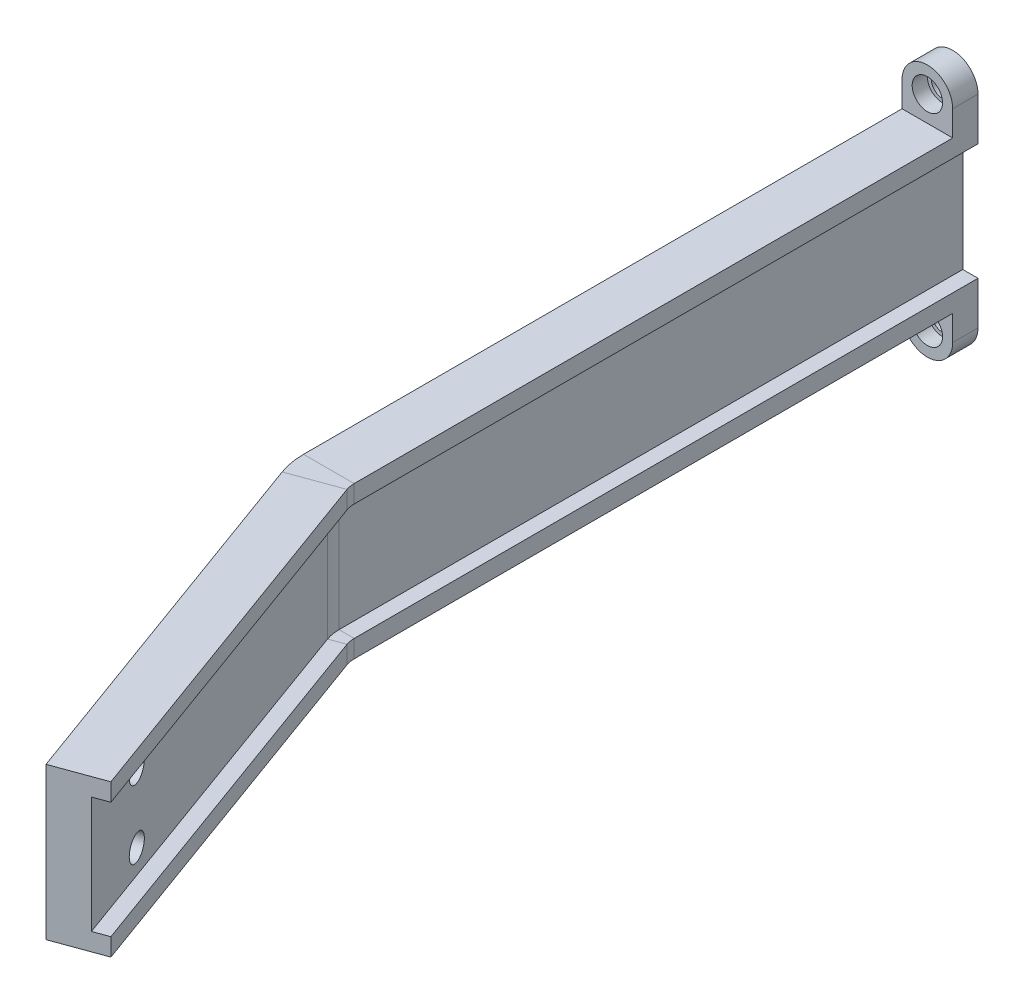
ISO-10303-21;
HEADER;
FILE_DESCRIPTION(('STEP AP214'),'2;1');
FILE_NAME('part.step','',(''),(''),'','','');
FILE_SCHEMA(('AUTOMOTIVE_DESIGN { 1 0 10303 214 1 1 1 1 }'));
ENDSEC;
DATA;
#1=APPLICATION_CONTEXT('core data for automotive mechanical design processes');
#2=APPLICATION_PROTOCOL_DEFINITION('international standard','automotive_design',2000,#1);
#3=PRODUCT_CONTEXT('',#1,'mechanical');
#4=PRODUCT('Part','Part','',(#3));
#5=PRODUCT_RELATED_PRODUCT_CATEGORY('part','',(#4));
#6=PRODUCT_DEFINITION_FORMATION('','',#4);
#7=PRODUCT_DEFINITION_CONTEXT('part definition',#1,'design');
#8=PRODUCT_DEFINITION('design','',#6,#7);
#9=PRODUCT_DEFINITION_SHAPE('','',#8);
#10=(LENGTH_UNIT() NAMED_UNIT(*) SI_UNIT(.MILLI.,.METRE.));
#11=(NAMED_UNIT(*) PLANE_ANGLE_UNIT() SI_UNIT($,.RADIAN.));
#12=(NAMED_UNIT(*) SI_UNIT($,.STERADIAN.) SOLID_ANGLE_UNIT());
#13=UNCERTAINTY_MEASURE_WITH_UNIT(LENGTH_MEASURE(1.E-05),#10,'distance_accuracy_value','');
#14=(GEOMETRIC_REPRESENTATION_CONTEXT(3) GLOBAL_UNCERTAINTY_ASSIGNED_CONTEXT((#13)) GLOBAL_UNIT_ASSIGNED_CONTEXT((#10,
#11,#12)) REPRESENTATION_CONTEXT('',''));
#15=CARTESIAN_POINT('',(0.,0.,0.));
#16=DIRECTION('',(0.,0.,1.));
#17=DIRECTION('',(1.,0.,0.));
#18=AXIS2_PLACEMENT_3D('',#15,#16,#17);
#19=CARTESIAN_POINT('',(-152.297767569966,11.5,9.99999999999995));
#20=DIRECTION('',(1.,0.,0.));
#21=DIRECTION('',(0.,0.,-1.));
#22=AXIS2_PLACEMENT_3D('',#19,#20,#21);
#23=PLANE('',#22);
#24=DIRECTION('',(0.,0.,1.));
#25=VECTOR('',#24,1.);
#26=CARTESIAN_POINT('',(-152.297767569966,11.5,9.99999999999995));
#27=LINE('',#26,#25);
#28=CARTESIAN_POINT('',(-152.297767569966,11.5,155.));
#29=VERTEX_POINT('',#28);
#30=CARTESIAN_POINT('',(-152.297767569965,11.5,278.236730192915));
#31=VERTEX_POINT('',#30);
#32=EDGE_CURVE('E242',#29,#31,#27,.T.);
#33=ORIENTED_EDGE('',*,*,#32,.F.);
#34=DIRECTION('',(0.,1.,0.));
#35=VECTOR('',#34,1.);
#36=CARTESIAN_POINT('',(-152.297767569966,11.5,155.));
#37=LINE('',#36,#35);
#38=CARTESIAN_POINT('',(-152.297767569965,20.,155.));
#39=VERTEX_POINT('',#38);
#40=EDGE_CURVE('E433',#29,#39,#37,.T.);
#41=ORIENTED_EDGE('',*,*,#40,.T.);
#42=DIRECTION('',(0.,0.,-1.));
#43=VECTOR('',#42,1.);
#44=CARTESIAN_POINT('',(-152.297767569965,20.,160.));
#45=LINE('',#44,#43);
#46=CARTESIAN_POINT('',(-152.297767569965,20.,160.));
#47=VERTEX_POINT('',#46);
#48=EDGE_CURVE('E227',#47,#39,#45,.T.);
#49=ORIENTED_EDGE('',*,*,#48,.F.);
#50=DIRECTION('',(0.,1.,0.));
#51=VECTOR('',#50,1.);
#52=CARTESIAN_POINT('',(-152.297767569965,15.,160.));
#53=LINE('',#52,#51);
#54=CARTESIAN_POINT('',(-152.297767569966,15.,160.));
#55=VERTEX_POINT('',#54);
#56=EDGE_CURVE('E222',#55,#47,#53,.T.);
#57=ORIENTED_EDGE('',*,*,#56,.F.);
#58=DIRECTION('',(0.,0.,1.));
#59=VECTOR('',#58,1.);
#60=CARTESIAN_POINT('',(-152.297767569966,15.,9.99999999999995));
#61=LINE('',#60,#59);
#62=CARTESIAN_POINT('',(-152.297767569965,15.,278.236730192915));
#63=VERTEX_POINT('',#62);
#64=EDGE_CURVE('E246',#55,#63,#61,.T.);
#65=ORIENTED_EDGE('',*,*,#64,.T.);
#66=DIRECTION('',(0.,1.,0.));
#67=VECTOR('',#66,1.);
#68=CARTESIAN_POINT('',(-152.297767569965,11.5,278.236730192915));
#69=LINE('',#68,#67);
#70=EDGE_CURVE('E243',#31,#63,#69,.T.);
#71=ORIENTED_EDGE('',*,*,#70,.F.);
#72=EDGE_LOOP('',(#33,#41,#49,#57,#65,#71));
#73=FACE_BOUND('',#72,.T.);
#74=ADVANCED_FACE('F41',(#73),#23,.T.);
#75=CARTESIAN_POINT('',(-162.297767569966,-15.,9.99999999999995));
#76=DIRECTION('',(-1.,0.,0.));
#77=DIRECTION('',(0.,0.,1.));
#78=AXIS2_PLACEMENT_3D('',#75,#76,#77);
#79=PLANE('',#78);
#80=DIRECTION('',(0.,0.,-1.));
#81=VECTOR('',#80,1.);
#82=CARTESIAN_POINT('',(-162.297767569965,20.,160.));
#83=LINE('',#82,#81);
#84=CARTESIAN_POINT('',(-162.297767569965,20.,160.));
#85=VERTEX_POINT('',#84);
#86=CARTESIAN_POINT('',(-162.297767569966,20.,155.));
#87=VERTEX_POINT('',#86);
#88=EDGE_CURVE('E196',#85,#87,#83,.T.);
#89=ORIENTED_EDGE('',*,*,#88,.T.);
#90=DIRECTION('',(0.,-1.,0.));
#91=VECTOR('',#90,1.);
#92=CARTESIAN_POINT('',(-162.297767569966,-15.,155.));
#93=LINE('',#92,#91);
#94=CARTESIAN_POINT('',(-162.297767569965,-20.,155.));
#95=VERTEX_POINT('',#94);
#96=EDGE_CURVE('E179',#87,#95,#93,.T.);
#97=ORIENTED_EDGE('',*,*,#96,.T.);
#98=DIRECTION('',(0.,0.,-1.));
#99=VECTOR('',#98,1.);
#100=CARTESIAN_POINT('',(-162.297767569965,-20.,160.));
#101=LINE('',#100,#99);
#102=CARTESIAN_POINT('',(-162.297767569965,-20.,160.));
#103=VERTEX_POINT('',#102);
#104=EDGE_CURVE('E192',#103,#95,#101,.T.);
#105=ORIENTED_EDGE('',*,*,#104,.F.);
#106=DIRECTION('',(0.,-1.,0.));
#107=VECTOR('',#106,1.);
#108=CARTESIAN_POINT('',(-162.297767569965,-15.,160.));
#109=LINE('',#108,#107);
#110=CARTESIAN_POINT('',(-162.297767569966,-15.,160.));
#111=VERTEX_POINT('',#110);
#112=EDGE_CURVE('E202',#111,#103,#109,.T.);
#113=ORIENTED_EDGE('',*,*,#112,.F.);
#114=DIRECTION('',(0.,0.,1.));
#115=VECTOR('',#114,1.);
#116=CARTESIAN_POINT('',(-162.297767569966,-15.,9.99999999999995));
#117=LINE('',#116,#115);
#118=CARTESIAN_POINT('',(-162.297767569965,-15.,278.236730192915));
#119=VERTEX_POINT('',#118);
#120=EDGE_CURVE('E64',#111,#119,#117,.T.);
#121=ORIENTED_EDGE('',*,*,#120,.T.);
#122=DIRECTION('',(0.,-1.,0.));
#123=VECTOR('',#122,1.);
#124=CARTESIAN_POINT('',(-162.297767569965,-15.,278.236730192915));
#125=LINE('',#124,#123);
#126=CARTESIAN_POINT('',(-162.297767569965,15.,278.236730192915));
#127=VERTEX_POINT('',#126);
#128=EDGE_CURVE('E275',#127,#119,#125,.T.);
#129=ORIENTED_EDGE('',*,*,#128,.F.);
#130=DIRECTION('',(0.,0.,1.));
#131=VECTOR('',#130,1.);
#132=CARTESIAN_POINT('',(-162.297767569966,15.,9.99999999999995));
#133=LINE('',#132,#131);
#134=CARTESIAN_POINT('',(-162.297767569965,15.,160.));
#135=VERTEX_POINT('',#134);
#136=EDGE_CURVE('E273',#135,#127,#133,.T.);
#137=ORIENTED_EDGE('',*,*,#136,.F.);
#138=DIRECTION('',(0.,-1.,0.));
#139=VECTOR('',#138,1.);
#140=CARTESIAN_POINT('',(-162.297767569965,15.,160.));
#141=LINE('',#140,#139);
#142=EDGE_CURVE('E216',#85,#135,#141,.T.);
#143=ORIENTED_EDGE('',*,*,#142,.F.);
#144=EDGE_LOOP('',(#89,#97,#105,#113,#121,#129,#137,#143));
#145=FACE_BOUND('',#144,.T.);
#146=ADVANCED_FACE('F190',(#145),#79,.T.);
#147=CARTESIAN_POINT('',(-152.297767569966,-15.,9.99999999999995));
#148=DIRECTION('',(1.,1.50408162385987E-13,0.));
#149=DIRECTION('',(-1.50408162385987E-13,1.,0.));
#150=AXIS2_PLACEMENT_3D('',#147,#148,#149);
#151=PLANE('',#150);
#152=DIRECTION('',(0.,0.,-1.));
#153=VECTOR('',#152,1.);
#154=CARTESIAN_POINT('',(-152.297767569965,-20.,160.));
#155=LINE('',#154,#153);
#156=CARTESIAN_POINT('',(-152.297767569965,-20.,160.));
#157=VERTEX_POINT('',#156);
#158=CARTESIAN_POINT('',(-152.297767569965,-20.,155.));
#159=VERTEX_POINT('',#158);
#160=EDGE_CURVE('E203',#157,#159,#155,.T.);
#161=ORIENTED_EDGE('',*,*,#160,.T.);
#162=DIRECTION('',(-1.50408162385987E-13,1.,0.));
#163=VECTOR('',#162,1.);
#164=CARTESIAN_POINT('',(-152.297767569966,-15.,155.));
#165=LINE('',#164,#163);
#166=CARTESIAN_POINT('',(-152.297767569966,-11.5,155.));
#167=VERTEX_POINT('',#166);
#168=EDGE_CURVE('E56',#159,#167,#165,.T.);
#169=ORIENTED_EDGE('',*,*,#168,.T.);
#170=DIRECTION('',(0.,0.,1.));
#171=VECTOR('',#170,1.);
#172=CARTESIAN_POINT('',(-152.297767569966,-11.5,9.99999999999995));
#173=LINE('',#172,#171);
#174=CARTESIAN_POINT('',(-152.297767569966,-11.5,278.236730192915));
#175=VERTEX_POINT('',#174);
#176=EDGE_CURVE('E320',#167,#175,#173,.T.);
#177=ORIENTED_EDGE('',*,*,#176,.T.);
#178=DIRECTION('',(-1.50408162385987E-13,1.,0.));
#179=VECTOR('',#178,1.);
#180=CARTESIAN_POINT('',(-152.297767569965,-15.,278.236730192915));
#181=LINE('',#180,#179);
#182=CARTESIAN_POINT('',(-152.297767569965,-15.,278.236730192915));
#183=VERTEX_POINT('',#182);
#184=EDGE_CURVE('E306',#183,#175,#181,.T.);
#185=ORIENTED_EDGE('',*,*,#184,.F.);
#186=DIRECTION('',(0.,0.,1.));
#187=VECTOR('',#186,1.);
#188=CARTESIAN_POINT('',(-152.297767569966,-15.,9.99999999999995));
#189=LINE('',#188,#187);
#190=CARTESIAN_POINT('',(-152.297767569965,-15.,160.));
#191=VERTEX_POINT('',#190);
#192=EDGE_CURVE('E304',#191,#183,#189,.T.);
#193=ORIENTED_EDGE('',*,*,#192,.F.);
#194=DIRECTION('',(0.,1.,0.));
#195=VECTOR('',#194,1.);
#196=CARTESIAN_POINT('',(-152.297767569965,-15.,160.));
#197=LINE('',#196,#195);
#198=EDGE_CURVE('E212',#157,#191,#197,.T.);
#199=ORIENTED_EDGE('',*,*,#198,.F.);
#200=EDGE_LOOP('',(#161,#169,#177,#185,#193,#199));
#201=FACE_BOUND('',#200,.T.);
#202=ADVANCED_FACE('F409',(#201),#151,.T.);
#203=CARTESIAN_POINT('',(-155.297767569966,-11.5,9.99999999999995));
#204=DIRECTION('',(0.,1.,0.));
#205=DIRECTION('',(0.,0.,1.));
#206=AXIS2_PLACEMENT_3D('',#203,#204,#205);
#207=PLANE('',#206);
#208=ORIENTED_EDGE('',*,*,#176,.F.);
#209=DIRECTION('',(-1.,0.,0.));
#210=VECTOR('',#209,1.);
#211=CARTESIAN_POINT('',(-155.297767569966,-11.5,155.));
#212=LINE('',#211,#210);
#213=CARTESIAN_POINT('',(-155.297767569966,-11.5,155.));
#214=VERTEX_POINT('',#213);
#215=EDGE_CURVE('E421',#167,#214,#212,.T.);
#216=ORIENTED_EDGE('',*,*,#215,.T.);
#217=DIRECTION('',(0.,0.,1.));
#218=VECTOR('',#217,1.);
#219=CARTESIAN_POINT('',(-155.297767569966,-11.5,9.99999999999995));
#220=LINE('',#219,#218);
#221=CARTESIAN_POINT('',(-155.297767569965,-11.5,278.236730192915));
#222=VERTEX_POINT('',#221);
#223=EDGE_CURVE('E336',#214,#222,#220,.T.);
#224=ORIENTED_EDGE('',*,*,#223,.T.);
#225=DIRECTION('',(-1.,0.,0.));
#226=VECTOR('',#225,1.);
#227=CARTESIAN_POINT('',(-155.297767569965,-11.5,278.236730192915));
#228=LINE('',#227,#226);
#229=EDGE_CURVE('E322',#175,#222,#228,.T.);
#230=ORIENTED_EDGE('',*,*,#229,.F.);
#231=EDGE_LOOP('',(#208,#216,#224,#230));
#232=FACE_BOUND('',#231,.T.);
#233=ADVANCED_FACE('F418',(#232),#207,.T.);
#234=CARTESIAN_POINT('',(-155.297767569966,-11.5,9.99999999999995));
#235=DIRECTION('',(1.,0.,0.));
#236=DIRECTION('',(0.,0.,-1.));
#237=AXIS2_PLACEMENT_3D('',#234,#235,#236);
#238=PLANE('',#237);
#239=ORIENTED_EDGE('',*,*,#223,.F.);
#240=DIRECTION('',(0.,1.,0.));
#241=VECTOR('',#240,1.);
#242=CARTESIAN_POINT('',(-155.297767569966,-11.5,155.));
#243=LINE('',#242,#241);
#244=CARTESIAN_POINT('',(-155.297767569966,11.5,155.));
#245=VERTEX_POINT('',#244);
#246=EDGE_CURVE('E429',#214,#245,#243,.T.);
#247=ORIENTED_EDGE('',*,*,#246,.T.);
#248=DIRECTION('',(0.,0.,1.));
#249=VECTOR('',#248,1.);
#250=CARTESIAN_POINT('',(-155.297767569966,11.5,9.99999999999995));
#251=LINE('',#250,#249);
#252=CARTESIAN_POINT('',(-155.297767569965,11.5,278.236730192915));
#253=VERTEX_POINT('',#252);
#254=EDGE_CURVE('E352',#245,#253,#251,.T.);
#255=ORIENTED_EDGE('',*,*,#254,.T.);
#256=DIRECTION('',(0.,1.,0.));
#257=VECTOR('',#256,1.);
#258=CARTESIAN_POINT('',(-155.297767569965,-11.5,278.236730192915));
#259=LINE('',#258,#257);
#260=EDGE_CURVE('E338',#222,#253,#259,.T.);
#261=ORIENTED_EDGE('',*,*,#260,.F.);
#262=EDGE_LOOP('',(#239,#247,#255,#261));
#263=FACE_BOUND('',#262,.T.);
#264=ADVANCED_FACE('F428',(#263),#238,.T.);
#265=CARTESIAN_POINT('',(-155.297767569966,11.5,9.99999999999995));
#266=DIRECTION('',(0.,-1.,0.));
#267=DIRECTION('',(0.,0.,-1.));
#268=AXIS2_PLACEMENT_3D('',#265,#266,#267);
#269=PLANE('',#268);
#270=ORIENTED_EDGE('',*,*,#254,.F.);
#271=DIRECTION('',(1.,0.,0.));
#272=VECTOR('',#271,1.);
#273=CARTESIAN_POINT('',(-155.297767569966,11.5,155.));
#274=LINE('',#273,#272);
#275=EDGE_CURVE('E432',#245,#29,#274,.T.);
#276=ORIENTED_EDGE('',*,*,#275,.T.);
#277=ORIENTED_EDGE('',*,*,#32,.T.);
#278=DIRECTION('',(1.,0.,0.));
#279=VECTOR('',#278,1.);
#280=CARTESIAN_POINT('',(-155.297767569965,11.5,278.236730192915));
#281=LINE('',#280,#279);
#282=EDGE_CURVE('E260',#253,#31,#281,.T.);
#283=ORIENTED_EDGE('',*,*,#282,.F.);
#284=EDGE_LOOP('',(#270,#276,#277,#283));
#285=FACE_BOUND('',#284,.T.);
#286=ADVANCED_FACE('F431',(#285),#269,.T.);
#287=CARTESIAN_POINT('',(-157.297767569965,20.,160.));
#288=DIRECTION('',(0.,0.,-1.));
#289=DIRECTION('',(-1.,0.,0.));
#290=AXIS2_PLACEMENT_3D('',#287,#288,#289);
#291=CYLINDRICAL_SURFACE('',#290,5.);
#292=CARTESIAN_POINT('',(-157.297767569965,20.,155.));
#293=DIRECTION('',(0.,0.,-1.));
#294=DIRECTION('',(-1.,0.,0.));
#295=AXIS2_PLACEMENT_3D('',#292,#293,#294);
#296=CIRCLE('',#295,5.);
#297=EDGE_CURVE('E197',#87,#39,#296,.T.);
#298=ORIENTED_EDGE('',*,*,#297,.F.);
#299=ORIENTED_EDGE('',*,*,#88,.F.);
#300=CARTESIAN_POINT('',(-157.297767569965,20.,160.));
#301=DIRECTION('',(0.,0.,1.));
#302=DIRECTION('',(1.,0.,0.));
#303=AXIS2_PLACEMENT_3D('',#300,#301,#302);
#304=CIRCLE('',#303,5.);
#305=EDGE_CURVE('E224',#47,#85,#304,.T.);
#306=ORIENTED_EDGE('',*,*,#305,.F.);
#307=ORIENTED_EDGE('',*,*,#48,.T.);
#308=EDGE_LOOP('',(#298,#299,#306,#307));
#309=FACE_BOUND('',#308,.T.);
#310=ADVANCED_FACE('F550',(#309),#291,.T.);
#311=CARTESIAN_POINT('',(-157.297767569965,-20.,160.));
#312=DIRECTION('',(0.,0.,-1.));
#313=DIRECTION('',(-1.,0.,0.));
#314=AXIS2_PLACEMENT_3D('',#311,#312,#313);
#315=CYLINDRICAL_SURFACE('',#314,5.);
#316=CARTESIAN_POINT('',(-157.297767569965,-20.,155.));
#317=DIRECTION('',(0.,0.,-1.));
#318=DIRECTION('',(-1.,0.,0.));
#319=AXIS2_PLACEMENT_3D('',#316,#317,#318);
#320=CIRCLE('',#319,5.);
#321=EDGE_CURVE('E175',#159,#95,#320,.T.);
#322=ORIENTED_EDGE('',*,*,#321,.F.);
#323=ORIENTED_EDGE('',*,*,#160,.F.);
#324=CARTESIAN_POINT('',(-157.297767569965,-20.,160.));
#325=DIRECTION('',(0.,0.,1.));
#326=DIRECTION('',(-1.,0.,0.));
#327=AXIS2_PLACEMENT_3D('',#324,#325,#326);
#328=CIRCLE('',#327,5.);
#329=EDGE_CURVE('E201',#103,#157,#328,.T.);
#330=ORIENTED_EDGE('',*,*,#329,.F.);
#331=ORIENTED_EDGE('',*,*,#104,.T.);
#332=EDGE_LOOP('',(#322,#323,#330,#331));
#333=FACE_BOUND('',#332,.T.);
#334=ADVANCED_FACE('F199',(#333),#315,.T.);
#335=CARTESIAN_POINT('',(-157.297767569965,-20.,160.));
#336=DIRECTION('',(0.,0.,1.));
#337=DIRECTION('',(1.,0.,0.));
#338=AXIS2_PLACEMENT_3D('',#335,#336,#337);
#339=CYLINDRICAL_SURFACE('',#338,2.25);
#340=CARTESIAN_POINT('',(-157.297767569965,-20.,157.));
#341=DIRECTION('',(0.,0.,1.));
#342=DIRECTION('',(1.,0.,0.));
#343=AXIS2_PLACEMENT_3D('',#340,#341,#342);
#344=CIRCLE('',#343,2.25);
#345=CARTESIAN_POINT('',(-155.047767569965,-20.,157.));
#346=VERTEX_POINT('',#345);
#347=EDGE_CURVE('E207',#346,#346,#344,.T.);
#348=ORIENTED_EDGE('',*,*,#347,.T.);
#349=EDGE_LOOP('',(#348));
#350=FACE_BOUND('',#349,.T.);
#351=CARTESIAN_POINT('',(-157.297767569965,-20.,155.));
#352=DIRECTION('',(0.,0.,-1.));
#353=DIRECTION('',(-1.,0.,0.));
#354=AXIS2_PLACEMENT_3D('',#351,#352,#353);
#355=CIRCLE('',#354,2.25);
#356=CARTESIAN_POINT('',(-159.547767569965,-20.,155.));
#357=VERTEX_POINT('',#356);
#358=EDGE_CURVE('E435',#357,#357,#355,.F.);
#359=ORIENTED_EDGE('',*,*,#358,.F.);
#360=EDGE_LOOP('',(#359));
#361=FACE_BOUND('',#360,.T.);
#362=ADVANCED_FACE('F459',(#350,#361),#339,.F.);
#363=CARTESIAN_POINT('',(-162.297767569966,-15.,9.99999999999995));
#364=DIRECTION('',(0.,-1.,0.));
#365=DIRECTION('',(1.,0.,0.));
#366=AXIS2_PLACEMENT_3D('',#363,#364,#365);
#367=PLANE('',#366);
#368=ORIENTED_EDGE('',*,*,#120,.F.);
#369=DIRECTION('',(-1.,0.,0.));
#370=VECTOR('',#369,1.);
#371=CARTESIAN_POINT('',(-162.297767569965,-15.,160.));
#372=LINE('',#371,#370);
#373=EDGE_CURVE('E205',#191,#111,#372,.T.);
#374=ORIENTED_EDGE('',*,*,#373,.F.);
#375=ORIENTED_EDGE('',*,*,#192,.T.);
#376=DIRECTION('',(1.,0.,0.));
#377=VECTOR('',#376,1.);
#378=CARTESIAN_POINT('',(-162.297767569965,-15.,278.236730192915));
#379=LINE('',#378,#377);
#380=EDGE_CURVE('E290',#119,#183,#379,.T.);
#381=ORIENTED_EDGE('',*,*,#380,.F.);
#382=EDGE_LOOP('',(#368,#374,#375,#381));
#383=FACE_BOUND('',#382,.T.);
#384=ADVANCED_FACE('F402',(#383),#367,.T.);
#385=CARTESIAN_POINT('',(98.8876895220948,0.,271.691694023993));
#386=DIRECTION('',(-0.342020143325671,0.,-0.939692620785908));
#387=DIRECTION('',(-0.939692620785908,0.,0.342020143325671));
#388=AXIS2_PLACEMENT_3D('',#385,#386,#387);
#389=PLANE('',#388);
#390=DIRECTION('',(0.,1.,0.));
#391=VECTOR('',#390,1.);
#392=CARTESIAN_POINT('',(-125.30153689607,11.5,353.289899283372));
#393=LINE('',#392,#391);
#394=CARTESIAN_POINT('',(-125.30153689607,11.5,353.289899283372));
#395=VERTEX_POINT('',#394);
#396=CARTESIAN_POINT('',(-125.30153689607,15.,353.289899283372));
#397=VERTEX_POINT('',#396);
#398=EDGE_CURVE('E261',#395,#397,#393,.T.);
#399=ORIENTED_EDGE('',*,*,#398,.T.);
#400=DIRECTION('',(-0.939692620785908,0.,0.342020143325671));
#401=VECTOR('',#400,1.);
#402=CARTESIAN_POINT('',(-134.69846310393,15.,356.710100716628));
#403=LINE('',#402,#401);
#404=CARTESIAN_POINT('',(-134.69846310393,15.,356.710100716628));
#405=VERTEX_POINT('',#404);
#406=EDGE_CURVE('E267',#397,#405,#403,.T.);
#407=ORIENTED_EDGE('',*,*,#406,.T.);
#408=DIRECTION('',(0.,-1.,0.));
#409=VECTOR('',#408,1.);
#410=CARTESIAN_POINT('',(-134.69846310393,-15.,356.710100716628));
#411=LINE('',#410,#409);
#412=CARTESIAN_POINT('',(-134.69846310393,-15.,356.710100716628));
#413=VERTEX_POINT('',#412);
#414=EDGE_CURVE('E286',#405,#413,#411,.T.);
#415=ORIENTED_EDGE('',*,*,#414,.T.);
#416=DIRECTION('',(0.939692620785908,0.,-0.342020143325671));
#417=VECTOR('',#416,1.);
#418=CARTESIAN_POINT('',(-134.69846310393,-15.,356.710100716628));
#419=LINE('',#418,#417);
#420=CARTESIAN_POINT('',(-125.30153689607,-15.,353.289899283372));
#421=VERTEX_POINT('',#420);
#422=EDGE_CURVE('E301',#413,#421,#419,.T.);
#423=ORIENTED_EDGE('',*,*,#422,.T.);
#424=DIRECTION('',(-1.42742960308949E-13,1.,0.));
#425=VECTOR('',#424,1.);
#426=CARTESIAN_POINT('',(-125.30153689607,-15.,353.289899283372));
#427=LINE('',#426,#425);
#428=CARTESIAN_POINT('',(-125.301536896071,-11.5,353.289899283372));
#429=VERTEX_POINT('',#428);
#430=EDGE_CURVE('E317',#421,#429,#427,.T.);
#431=ORIENTED_EDGE('',*,*,#430,.T.);
#432=DIRECTION('',(-0.939692620785909,0.,0.342020143325668));
#433=VECTOR('',#432,1.);
#434=CARTESIAN_POINT('',(-128.120614758428,-11.5,354.315959713349));
#435=LINE('',#434,#433);
#436=CARTESIAN_POINT('',(-128.120614758428,-11.5,354.315959713349));
#437=VERTEX_POINT('',#436);
#438=EDGE_CURVE('E333',#429,#437,#435,.T.);
#439=ORIENTED_EDGE('',*,*,#438,.T.);
#440=DIRECTION('',(0.,1.,0.));
#441=VECTOR('',#440,1.);
#442=CARTESIAN_POINT('',(-128.120614758428,-11.5,354.315959713349));
#443=LINE('',#442,#441);
#444=CARTESIAN_POINT('',(-128.120614758428,11.5,354.315959713349));
#445=VERTEX_POINT('',#444);
#446=EDGE_CURVE('E349',#437,#445,#443,.T.);
#447=ORIENTED_EDGE('',*,*,#446,.T.);
#448=DIRECTION('',(0.93969262078591,0.,-0.342020143325663));
#449=VECTOR('',#448,1.);
#450=CARTESIAN_POINT('',(-128.120614758428,11.5,354.315959713349));
#451=LINE('',#450,#449);
#452=EDGE_CURVE('E11',#445,#395,#451,.T.);
#453=ORIENTED_EDGE('',*,*,#452,.T.);
#454=EDGE_LOOP('',(#399,#407,#415,#423,#431,#439,#447,#453));
#455=FACE_BOUND('',#454,.T.);
#456=ADVANCED_FACE('F43',(#455),#389,.F.);
#457=CARTESIAN_POINT('',(-162.297767569966,15.,9.99999999999995));
#458=DIRECTION('',(0.,1.,0.));
#459=DIRECTION('',(-1.,0.,0.));
#460=AXIS2_PLACEMENT_3D('',#457,#458,#459);
#461=PLANE('',#460);
#462=DIRECTION('',(1.,0.,0.));
#463=VECTOR('',#462,1.);
#464=CARTESIAN_POINT('',(-162.297767569965,15.,160.));
#465=LINE('',#464,#463);
#466=EDGE_CURVE('E219',#135,#55,#465,.T.);
#467=ORIENTED_EDGE('',*,*,#466,.F.);
#468=ORIENTED_EDGE('',*,*,#136,.T.);
#469=DIRECTION('',(-1.,0.,0.));
#470=VECTOR('',#469,1.);
#471=CARTESIAN_POINT('',(-162.297767569965,15.,278.236730192915));
#472=LINE('',#471,#470);
#473=EDGE_CURVE('E248',#63,#127,#472,.T.);
#474=ORIENTED_EDGE('',*,*,#473,.F.);
#475=ORIENTED_EDGE('',*,*,#64,.F.);
#476=EDGE_LOOP('',(#467,#468,#474,#475));
#477=FACE_BOUND('',#476,.T.);
#478=ADVANCED_FACE('F392',(#477),#461,.T.);
#479=CARTESIAN_POINT('',(-147.297767569966,0.,278.236730192915));
#480=DIRECTION('',(0.,1.,0.));
#481=DIRECTION('',(0.,0.,1.));
#482=AXIS2_PLACEMENT_3D('',#479,#480,#481);
#483=CYLINDRICAL_SURFACE('',#482,4.99999999999945);
#484=CARTESIAN_POINT('',(-147.297767569966,15.,278.236730192915));
#485=DIRECTION('',(0.,1.,0.));
#486=DIRECTION('',(-1.,0.,0.));
#487=AXIS2_PLACEMENT_3D('',#484,#485,#486);
#488=CIRCLE('',#487,4.99999999999945);
#489=CARTESIAN_POINT('',(-151.996230673897,15.,279.946830909537));
#490=VERTEX_POINT('',#489);
#491=EDGE_CURVE('E253',#63,#490,#488,.T.);
#492=ORIENTED_EDGE('',*,*,#491,.T.);
#493=DIRECTION('',(0.,1.,0.));
#494=VECTOR('',#493,1.);
#495=CARTESIAN_POINT('',(-151.996230673905,11.5,279.94683090954));
#496=LINE('',#495,#494);
#497=CARTESIAN_POINT('',(-151.996230673897,11.5,279.946830909537));
#498=VERTEX_POINT('',#497);
#499=EDGE_CURVE('E250',#498,#490,#496,.T.);
#500=ORIENTED_EDGE('',*,*,#499,.F.);
#501=CARTESIAN_POINT('',(-147.297767569966,11.5,278.236730192915));
#502=DIRECTION('',(0.,1.,0.));
#503=DIRECTION('',(-1.,0.,0.));
#504=AXIS2_PLACEMENT_3D('',#501,#502,#503);
#505=CIRCLE('',#504,4.99999999999945);
#506=EDGE_CURVE('E254',#31,#498,#505,.T.);
#507=ORIENTED_EDGE('',*,*,#506,.F.);
#508=ORIENTED_EDGE('',*,*,#70,.T.);
#509=EDGE_LOOP('',(#492,#500,#507,#508));
#510=FACE_BOUND('',#509,.T.);
#511=ADVANCED_FACE('F373',(#510),#483,.F.);
#512=CARTESIAN_POINT('',(-162.297767569965,15.,278.236730192915));
#513=DIRECTION('',(0.,1.,0.));
#514=DIRECTION('',(0.,0.,1.));
#515=AXIS2_PLACEMENT_3D('',#512,#513,#514);
#516=PLANE('',#515);
#517=CARTESIAN_POINT('',(-147.297767569966,15.,278.236730192915));
#518=DIRECTION('',(0.,1.,0.));
#519=DIRECTION('',(-1.,0.,0.));
#520=AXIS2_PLACEMENT_3D('',#517,#518,#519);
#521=CIRCLE('',#520,14.9999999999995);
#522=CARTESIAN_POINT('',(-161.393156881756,15.,283.367032342794));
#523=VERTEX_POINT('',#522);
#524=EDGE_CURVE('E278',#127,#523,#521,.T.);
#525=ORIENTED_EDGE('',*,*,#524,.T.);
#526=DIRECTION('',(-0.939692620785908,0.,0.342020143325671));
#527=VECTOR('',#526,1.);
#528=CARTESIAN_POINT('',(-161.393156881764,15.,283.367032342797));
#529=LINE('',#528,#527);
#530=EDGE_CURVE('E257',#490,#523,#529,.T.);
#531=ORIENTED_EDGE('',*,*,#530,.F.);
#532=ORIENTED_EDGE('',*,*,#491,.F.);
#533=ORIENTED_EDGE('',*,*,#473,.T.);
#534=EDGE_LOOP('',(#525,#531,#532,#533));
#535=FACE_BOUND('',#534,.T.);
#536=ADVANCED_FACE('F391',(#535),#516,.T.);
#537=CARTESIAN_POINT('',(-147.297767569966,0.,278.236730192915));
#538=DIRECTION('',(0.,1.,0.));
#539=DIRECTION('',(0.,0.,1.));
#540=AXIS2_PLACEMENT_3D('',#537,#538,#539);
#541=CYLINDRICAL_SURFACE('',#540,14.9999999999995);
#542=CARTESIAN_POINT('',(-147.297767569966,-15.,278.236730192915));
#543=DIRECTION('',(0.,1.,0.));
#544=DIRECTION('',(-1.,0.,0.));
#545=AXIS2_PLACEMENT_3D('',#542,#543,#544);
#546=CIRCLE('',#545,14.9999999999995);
#547=CARTESIAN_POINT('',(-161.393156881756,-15.,283.367032342794));
#548=VERTEX_POINT('',#547);
#549=EDGE_CURVE('E293',#119,#548,#546,.T.);
#550=ORIENTED_EDGE('',*,*,#549,.T.);
#551=DIRECTION('',(0.,-1.,0.));
#552=VECTOR('',#551,1.);
#553=CARTESIAN_POINT('',(-161.393156881764,-15.,283.367032342797));
#554=LINE('',#553,#552);
#555=EDGE_CURVE('E281',#523,#548,#554,.T.);
#556=ORIENTED_EDGE('',*,*,#555,.F.);
#557=ORIENTED_EDGE('',*,*,#524,.F.);
#558=ORIENTED_EDGE('',*,*,#128,.T.);
#559=EDGE_LOOP('',(#550,#556,#557,#558));
#560=FACE_BOUND('',#559,.T.);
#561=ADVANCED_FACE('F397',(#560),#541,.T.);
#562=CARTESIAN_POINT('',(-162.297767569965,-15.,278.236730192915));
#563=DIRECTION('',(0.,-1.,0.));
#564=DIRECTION('',(0.,0.,-1.));
#565=AXIS2_PLACEMENT_3D('',#562,#563,#564);
#566=PLANE('',#565);
#567=CARTESIAN_POINT('',(-147.297767569966,-15.,278.236730192915));
#568=DIRECTION('',(0.,1.,0.));
#569=DIRECTION('',(-1.,0.,0.));
#570=AXIS2_PLACEMENT_3D('',#567,#568,#569);
#571=CIRCLE('',#570,4.99999999999945);
#572=CARTESIAN_POINT('',(-151.996230673897,-15.,279.946830909537));
#573=VERTEX_POINT('',#572);
#574=EDGE_CURVE('E309',#183,#573,#571,.T.);
#575=ORIENTED_EDGE('',*,*,#574,.T.);
#576=DIRECTION('',(0.939692620785908,0.,-0.342020143325671));
#577=VECTOR('',#576,1.);
#578=CARTESIAN_POINT('',(-161.393156881764,-15.,283.367032342797));
#579=LINE('',#578,#577);
#580=EDGE_CURVE('E296',#548,#573,#579,.T.);
#581=ORIENTED_EDGE('',*,*,#580,.F.);
#582=ORIENTED_EDGE('',*,*,#549,.F.);
#583=ORIENTED_EDGE('',*,*,#380,.T.);
#584=EDGE_LOOP('',(#575,#581,#582,#583));
#585=FACE_BOUND('',#584,.T.);
#586=ADVANCED_FACE('F401',(#585),#566,.T.);
#587=CARTESIAN_POINT('',(-147.297767569966,0.,278.236730192915));
#588=DIRECTION('',(0.,1.,0.));
#589=DIRECTION('',(0.,0.,1.));
#590=AXIS2_PLACEMENT_3D('',#587,#588,#589);
#591=CYLINDRICAL_SURFACE('',#590,4.99999999999971);
#592=CARTESIAN_POINT('',(-147.297767569966,-11.5,278.236730192915));
#593=DIRECTION('',(0.,1.,0.));
#594=DIRECTION('',(-1.,0.,0.));
#595=AXIS2_PLACEMENT_3D('',#592,#593,#594);
#596=CIRCLE('',#595,4.99999999999995);
#597=CARTESIAN_POINT('',(-151.996230673898,-11.5,279.946830909537));
#598=VERTEX_POINT('',#597);
#599=EDGE_CURVE('E325',#175,#598,#596,.T.);
#600=ORIENTED_EDGE('',*,*,#599,.T.);
#601=DIRECTION('',(-1.42742960308949E-13,1.,0.));
#602=VECTOR('',#601,1.);
#603=CARTESIAN_POINT('',(-151.996230673905,-15.,279.94683090954));
#604=LINE('',#603,#602);
#605=EDGE_CURVE('E312',#573,#598,#604,.T.);
#606=ORIENTED_EDGE('',*,*,#605,.F.);
#607=ORIENTED_EDGE('',*,*,#574,.F.);
#608=ORIENTED_EDGE('',*,*,#184,.T.);
#609=EDGE_LOOP('',(#600,#606,#607,#608));
#610=FACE_BOUND('',#609,.T.);
#611=ADVANCED_FACE('F408',(#610),#591,.F.);
#612=CARTESIAN_POINT('',(-155.297767569965,-11.5,278.236730192915));
#613=DIRECTION('',(0.,1.,0.));
#614=DIRECTION('',(0.,0.,1.));
#615=AXIS2_PLACEMENT_3D('',#612,#613,#614);
#616=PLANE('',#615);
#617=CARTESIAN_POINT('',(-147.297767569966,-11.5,278.236730192915));
#618=DIRECTION('',(0.,1.,0.));
#619=DIRECTION('',(-1.,0.,0.));
#620=AXIS2_PLACEMENT_3D('',#617,#618,#619);
#621=CIRCLE('',#620,7.99999999999945);
#622=CARTESIAN_POINT('',(-154.815308536255,-11.5,280.972891339514));
#623=VERTEX_POINT('',#622);
#624=EDGE_CURVE('E341',#222,#623,#621,.T.);
#625=ORIENTED_EDGE('',*,*,#624,.T.);
#626=DIRECTION('',(-0.939692620785909,0.,0.342020143325668));
#627=VECTOR('',#626,1.);
#628=CARTESIAN_POINT('',(-154.815308536263,-11.5,280.972891339517));
#629=LINE('',#628,#627);
#630=EDGE_CURVE('E328',#598,#623,#629,.T.);
#631=ORIENTED_EDGE('',*,*,#630,.F.);
#632=ORIENTED_EDGE('',*,*,#599,.F.);
#633=ORIENTED_EDGE('',*,*,#229,.T.);
#634=EDGE_LOOP('',(#625,#631,#632,#633));
#635=FACE_BOUND('',#634,.T.);
#636=ADVANCED_FACE('F417',(#635),#616,.T.);
#637=CARTESIAN_POINT('',(-147.297767569966,0.,278.236730192915));
#638=DIRECTION('',(0.,1.,0.));
#639=DIRECTION('',(0.,0.,1.));
#640=AXIS2_PLACEMENT_3D('',#637,#638,#639);
#641=CYLINDRICAL_SURFACE('',#640,7.99999999999945);
#642=CARTESIAN_POINT('',(-147.297767569966,11.5,278.236730192915));
#643=DIRECTION('',(0.,1.,0.));
#644=DIRECTION('',(-1.,0.,0.));
#645=AXIS2_PLACEMENT_3D('',#642,#643,#644);
#646=CIRCLE('',#645,7.99999999999945);
#647=CARTESIAN_POINT('',(-154.815308536255,11.5,280.972891339514));
#648=VERTEX_POINT('',#647);
#649=EDGE_CURVE('E356',#253,#648,#646,.T.);
#650=ORIENTED_EDGE('',*,*,#649,.T.);
#651=DIRECTION('',(0.,1.,0.));
#652=VECTOR('',#651,1.);
#653=CARTESIAN_POINT('',(-154.815308536263,-11.5,280.972891339517));
#654=LINE('',#653,#652);
#655=EDGE_CURVE('E344',#623,#648,#654,.T.);
#656=ORIENTED_EDGE('',*,*,#655,.F.);
#657=ORIENTED_EDGE('',*,*,#624,.F.);
#658=ORIENTED_EDGE('',*,*,#260,.T.);
#659=EDGE_LOOP('',(#650,#656,#657,#658));
#660=FACE_BOUND('',#659,.T.);
#661=ADVANCED_FACE('F427',(#660),#641,.F.);
#662=CARTESIAN_POINT('',(-155.297767569965,11.5,278.236730192915));
#663=DIRECTION('',(0.,-1.,0.));
#664=DIRECTION('',(0.,0.,-1.));
#665=AXIS2_PLACEMENT_3D('',#662,#663,#664);
#666=PLANE('',#665);
#667=DIRECTION('',(0.93969262078591,0.,-0.342020143325663));
#668=VECTOR('',#667,1.);
#669=CARTESIAN_POINT('',(-154.815308536263,11.5,280.972891339517));
#670=LINE('',#669,#668);
#671=EDGE_CURVE('E270',#648,#498,#670,.T.);
#672=ORIENTED_EDGE('',*,*,#671,.F.);
#673=ORIENTED_EDGE('',*,*,#649,.F.);
#674=ORIENTED_EDGE('',*,*,#282,.T.);
#675=ORIENTED_EDGE('',*,*,#506,.T.);
#676=EDGE_LOOP('',(#672,#673,#674,#675));
#677=FACE_BOUND('',#676,.T.);
#678=ADVANCED_FACE('F376',(#677),#666,.T.);
#679=CARTESIAN_POINT('',(-151.996230673895,11.5,279.946830909544));
#680=DIRECTION('',(0.939692620785908,0.,-0.34202014332567));
#681=DIRECTION('',(-0.34202014332567,0.,-0.939692620785908));
#682=AXIS2_PLACEMENT_3D('',#679,#680,#681);
#683=PLANE('',#682);
#684=DIRECTION('',(0.34202014332567,0.,0.939692620785908));
#685=VECTOR('',#684,1.);
#686=CARTESIAN_POINT('',(-151.996230673895,15.,279.946830909544));
#687=LINE('',#686,#685);
#688=EDGE_CURVE('E263',#490,#397,#687,.T.);
#689=ORIENTED_EDGE('',*,*,#688,.T.);
#690=ORIENTED_EDGE('',*,*,#398,.F.);
#691=DIRECTION('',(0.34202014332567,0.,0.939692620785908));
#692=VECTOR('',#691,1.);
#693=CARTESIAN_POINT('',(-151.996230673895,11.5,279.946830909544));
#694=LINE('',#693,#692);
#695=EDGE_CURVE('E264',#498,#395,#694,.T.);
#696=ORIENTED_EDGE('',*,*,#695,.F.);
#697=ORIENTED_EDGE('',*,*,#499,.T.);
#698=EDGE_LOOP('',(#689,#690,#696,#697));
#699=FACE_BOUND('',#698,.T.);
#700=ADVANCED_FACE('F499',(#699),#683,.T.);
#701=CARTESIAN_POINT('',(-161.393156881754,15.,283.3670323428));
#702=DIRECTION('',(0.,1.,0.));
#703=DIRECTION('',(-1.,0.,0.));
#704=AXIS2_PLACEMENT_3D('',#701,#702,#703);
#705=PLANE('',#704);
#706=DIRECTION('',(0.34202014332567,0.,0.939692620785908));
#707=VECTOR('',#706,1.);
#708=CARTESIAN_POINT('',(-161.393156881754,15.,283.3670323428));
#709=LINE('',#708,#707);
#710=EDGE_CURVE('E283',#523,#405,#709,.T.);
#711=ORIENTED_EDGE('',*,*,#710,.T.);
#712=ORIENTED_EDGE('',*,*,#406,.F.);
#713=ORIENTED_EDGE('',*,*,#688,.F.);
#714=ORIENTED_EDGE('',*,*,#530,.T.);
#715=EDGE_LOOP('',(#711,#712,#713,#714));
#716=FACE_BOUND('',#715,.T.);
#717=ADVANCED_FACE('F502',(#716),#705,.T.);
#718=CARTESIAN_POINT('',(-161.393156881754,-15.,283.3670323428));
#719=DIRECTION('',(-0.939692620785908,0.,0.34202014332567));
#720=DIRECTION('',(0.34202014332567,0.,0.939692620785908));
#721=AXIS2_PLACEMENT_3D('',#718,#719,#720);
#722=PLANE('',#721);
#723=CARTESIAN_POINT('',(-139.828765253815,6.75,342.61471140484));
#724=DIRECTION('',(-0.939692620785908,0.,0.34202014332567));
#725=DIRECTION('',(0.34202014332567,0.,0.939692620785908));
#726=AXIS2_PLACEMENT_3D('',#723,#724,#725);
#727=CIRCLE('',#726,2.50000000000003);
#728=CARTESIAN_POINT('',(-138.9737148955,6.75,344.963942956804));
#729=VERTEX_POINT('',#728);
#730=EDGE_CURVE('E239',#729,#729,#727,.T.);
#731=ORIENTED_EDGE('',*,*,#730,.F.);
#732=EDGE_LOOP('',(#731));
#733=FACE_BOUND('',#732,.T.);
#734=CARTESIAN_POINT('',(-139.828765253815,-6.74999999999999,342.61471140484));
#735=DIRECTION('',(-0.939692620785908,0.,0.34202014332567));
#736=DIRECTION('',(0.34202014332567,0.,0.939692620785908));
#737=AXIS2_PLACEMENT_3D('',#734,#735,#736);
#738=CIRCLE('',#737,2.50000000000003);
#739=CARTESIAN_POINT('',(-138.9737148955,-6.74999999999999,344.963942956804));
#740=VERTEX_POINT('',#739);
#741=EDGE_CURVE('E234',#740,#740,#738,.T.);
#742=ORIENTED_EDGE('',*,*,#741,.F.);
#743=EDGE_LOOP('',(#742));
#744=FACE_BOUND('',#743,.T.);
#745=DIRECTION('',(0.34202014332567,0.,0.939692620785908));
#746=VECTOR('',#745,1.);
#747=CARTESIAN_POINT('',(-161.393156881754,-15.,283.3670323428));
#748=LINE('',#747,#746);
#749=EDGE_CURVE('E298',#548,#413,#748,.T.);
#750=ORIENTED_EDGE('',*,*,#749,.T.);
#751=ORIENTED_EDGE('',*,*,#414,.F.);
#752=ORIENTED_EDGE('',*,*,#710,.F.);
#753=ORIENTED_EDGE('',*,*,#555,.T.);
#754=EDGE_LOOP('',(#750,#751,#752,#753));
#755=FACE_BOUND('',#754,.T.);
#756=ADVANCED_FACE('F508',(#733,#744,#755),#722,.T.);
#757=CARTESIAN_POINT('',(-161.393156881754,-15.,283.3670323428));
#758=DIRECTION('',(0.,-1.,0.));
#759=DIRECTION('',(1.,0.,0.));
#760=AXIS2_PLACEMENT_3D('',#757,#758,#759);
#761=PLANE('',#760);
#762=DIRECTION('',(0.34202014332567,0.,0.939692620785908));
#763=VECTOR('',#762,1.);
#764=CARTESIAN_POINT('',(-151.996230673895,-15.,279.946830909544));
#765=LINE('',#764,#763);
#766=EDGE_CURVE('E314',#573,#421,#765,.T.);
#767=ORIENTED_EDGE('',*,*,#766,.T.);
#768=ORIENTED_EDGE('',*,*,#422,.F.);
#769=ORIENTED_EDGE('',*,*,#749,.F.);
#770=ORIENTED_EDGE('',*,*,#580,.T.);
#771=EDGE_LOOP('',(#767,#768,#769,#770));
#772=FACE_BOUND('',#771,.T.);
#773=ADVANCED_FACE('F515',(#772),#761,.T.);
#774=CARTESIAN_POINT('',(-151.996230673895,-15.,279.946830909544));
#775=DIRECTION('',(0.939692620785908,1.50408162385987E-13,-0.34202014332567));
#776=DIRECTION('',(-0.34202014332567,0.,-0.939692620785908));
#777=AXIS2_PLACEMENT_3D('',#774,#775,#776);
#778=PLANE('',#777);
#779=DIRECTION('',(0.34202014332567,0.,0.939692620785908));
#780=VECTOR('',#779,1.);
#781=CARTESIAN_POINT('',(-151.996230673895,-11.5,279.946830909544));
#782=LINE('',#781,#780);
#783=EDGE_CURVE('E330',#598,#429,#782,.T.);
#784=ORIENTED_EDGE('',*,*,#783,.T.);
#785=ORIENTED_EDGE('',*,*,#430,.F.);
#786=ORIENTED_EDGE('',*,*,#766,.F.);
#787=ORIENTED_EDGE('',*,*,#605,.T.);
#788=EDGE_LOOP('',(#784,#785,#786,#787));
#789=FACE_BOUND('',#788,.T.);
#790=ADVANCED_FACE('F523',(#789),#778,.T.);
#791=CARTESIAN_POINT('',(-154.815308536253,-11.5,280.972891339521));
#792=DIRECTION('',(0.,1.,0.));
#793=DIRECTION('',(0.,0.,1.));
#794=AXIS2_PLACEMENT_3D('',#791,#792,#793);
#795=PLANE('',#794);
#796=DIRECTION('',(0.34202014332567,0.,0.939692620785908));
#797=VECTOR('',#796,1.);
#798=CARTESIAN_POINT('',(-154.815308536253,-11.5,280.972891339521));
#799=LINE('',#798,#797);
#800=EDGE_CURVE('E346',#623,#437,#799,.T.);
#801=ORIENTED_EDGE('',*,*,#800,.T.);
#802=ORIENTED_EDGE('',*,*,#438,.F.);
#803=ORIENTED_EDGE('',*,*,#783,.F.);
#804=ORIENTED_EDGE('',*,*,#630,.T.);
#805=EDGE_LOOP('',(#801,#802,#803,#804));
#806=FACE_BOUND('',#805,.T.);
#807=ADVANCED_FACE('F531',(#806),#795,.T.);
#808=CARTESIAN_POINT('',(-154.815308536253,-11.5,280.972891339521));
#809=DIRECTION('',(0.939692620785908,0.,-0.34202014332567));
#810=DIRECTION('',(-0.34202014332567,0.,-0.939692620785908));
#811=AXIS2_PLACEMENT_3D('',#808,#809,#810);
#812=PLANE('',#811);
#813=CARTESIAN_POINT('',(-133.250916908313,6.75,340.22057040156));
#814=DIRECTION('',(0.939692620785908,0.,-0.34202014332567));
#815=DIRECTION('',(-0.34202014332567,0.,-0.939692620785908));
#816=AXIS2_PLACEMENT_3D('',#813,#814,#815);
#817=CIRCLE('',#816,2.50000000000003);
#818=CARTESIAN_POINT('',(-134.105967266627,6.75,337.871338849595));
#819=VERTEX_POINT('',#818);
#820=EDGE_CURVE('E231',#819,#819,#817,.T.);
#821=ORIENTED_EDGE('',*,*,#820,.F.);
#822=EDGE_LOOP('',(#821));
#823=FACE_BOUND('',#822,.T.);
#824=CARTESIAN_POINT('',(-133.250916908313,-6.74999999999999,340.22057040156));
#825=DIRECTION('',(0.939692620785908,0.,-0.34202014332567));
#826=DIRECTION('',(0.34202014332567,0.,0.939692620785908));
#827=AXIS2_PLACEMENT_3D('',#824,#825,#826);
#828=CIRCLE('',#827,2.50000000000003);
#829=CARTESIAN_POINT('',(-132.395866549999,-6.74999999999999,342.569801953525));
#830=VERTEX_POINT('',#829);
#831=EDGE_CURVE('E230',#830,#830,#828,.T.);
#832=ORIENTED_EDGE('',*,*,#831,.F.);
#833=EDGE_LOOP('',(#832));
#834=FACE_BOUND('',#833,.T.);
#835=DIRECTION('',(0.34202014332567,0.,0.939692620785908));
#836=VECTOR('',#835,1.);
#837=CARTESIAN_POINT('',(-154.815308536253,11.5,280.972891339521));
#838=LINE('',#837,#836);
#839=EDGE_CURVE('E49',#648,#445,#838,.T.);
#840=ORIENTED_EDGE('',*,*,#839,.T.);
#841=ORIENTED_EDGE('',*,*,#446,.F.);
#842=ORIENTED_EDGE('',*,*,#800,.F.);
#843=ORIENTED_EDGE('',*,*,#655,.T.);
#844=EDGE_LOOP('',(#840,#841,#842,#843));
#845=FACE_BOUND('',#844,.T.);
#846=ADVANCED_FACE('F539',(#823,#834,#845),#812,.T.);
#847=CARTESIAN_POINT('',(-154.815308536253,11.5,280.972891339521));
#848=DIRECTION('',(0.,-1.,0.));
#849=DIRECTION('',(0.,0.,-1.));
#850=AXIS2_PLACEMENT_3D('',#847,#848,#849);
#851=PLANE('',#850);
#852=ORIENTED_EDGE('',*,*,#452,.F.);
#853=ORIENTED_EDGE('',*,*,#839,.F.);
#854=ORIENTED_EDGE('',*,*,#671,.T.);
#855=ORIENTED_EDGE('',*,*,#695,.T.);
#856=EDGE_LOOP('',(#852,#853,#854,#855));
#857=FACE_BOUND('',#856,.T.);
#858=ADVANCED_FACE('F368',(#857),#851,.T.);
#859=CARTESIAN_POINT('',(-164.199564396911,-6.74999999999999,351.484956878207));
#860=DIRECTION('',(0.939692620785908,0.,-0.34202014332567));
#861=DIRECTION('',(-0.34202014332567,0.,-0.939692620785908));
#862=AXIS2_PLACEMENT_3D('',#859,#860,#861);
#863=CYLINDRICAL_SURFACE('',#862,2.50000000000003);
#864=ORIENTED_EDGE('',*,*,#741,.T.);
#865=EDGE_LOOP('',(#864));
#866=FACE_BOUND('',#865,.T.);
#867=ORIENTED_EDGE('',*,*,#831,.T.);
#868=EDGE_LOOP('',(#867));
#869=FACE_BOUND('',#868,.T.);
#870=ADVANCED_FACE('F495',(#866,#869),#863,.F.);
#871=CARTESIAN_POINT('',(-164.199564396911,6.75,351.484956878207));
#872=DIRECTION('',(0.939692620785908,0.,-0.34202014332567));
#873=DIRECTION('',(-0.34202014332567,0.,-0.939692620785908));
#874=AXIS2_PLACEMENT_3D('',#871,#872,#873);
#875=CYLINDRICAL_SURFACE('',#874,2.50000000000003);
#876=ORIENTED_EDGE('',*,*,#730,.T.);
#877=EDGE_LOOP('',(#876));
#878=FACE_BOUND('',#877,.T.);
#879=ORIENTED_EDGE('',*,*,#820,.T.);
#880=EDGE_LOOP('',(#879));
#881=FACE_BOUND('',#880,.T.);
#882=ADVANCED_FACE('F483',(#878,#881),#875,.F.);
#883=CARTESIAN_POINT('',(-157.297767569965,20.,160.));
#884=DIRECTION('',(0.,0.,1.));
#885=DIRECTION('',(1.,0.,0.));
#886=AXIS2_PLACEMENT_3D('',#883,#884,#885);
#887=PLANE('',#886);
#888=CARTESIAN_POINT('',(-157.297767569965,20.,160.));
#889=DIRECTION('',(0.,0.,1.));
#890=DIRECTION('',(1.,0.,0.));
#891=AXIS2_PLACEMENT_3D('',#888,#889,#890);
#892=CIRCLE('',#891,3.);
#893=CARTESIAN_POINT('',(-154.297767569965,20.,160.));
#894=VERTEX_POINT('',#893);
#895=EDGE_CURVE('E442',#894,#894,#892,.T.);
#896=ORIENTED_EDGE('',*,*,#895,.F.);
#897=EDGE_LOOP('',(#896));
#898=FACE_BOUND('',#897,.T.);
#899=ORIENTED_EDGE('',*,*,#142,.T.);
#900=ORIENTED_EDGE('',*,*,#466,.T.);
#901=ORIENTED_EDGE('',*,*,#56,.T.);
#902=ORIENTED_EDGE('',*,*,#305,.T.);
#903=EDGE_LOOP('',(#899,#900,#901,#902));
#904=FACE_BOUND('',#903,.T.);
#905=ADVANCED_FACE('F478',(#898,#904),#887,.T.);
#906=CARTESIAN_POINT('',(-157.297767569965,-20.,160.));
#907=DIRECTION('',(0.,0.,-1.));
#908=DIRECTION('',(-1.,0.,0.));
#909=AXIS2_PLACEMENT_3D('',#906,#907,#908);
#910=PLANE('',#909);
#911=CARTESIAN_POINT('',(-157.297767569965,-20.,160.));
#912=DIRECTION('',(0.,0.,1.));
#913=DIRECTION('',(1.,0.,0.));
#914=AXIS2_PLACEMENT_3D('',#911,#912,#913);
#915=CIRCLE('',#914,3.);
#916=CARTESIAN_POINT('',(-154.297767569965,-20.,160.));
#917=VERTEX_POINT('',#916);
#918=EDGE_CURVE('E451',#917,#917,#915,.T.);
#919=ORIENTED_EDGE('',*,*,#918,.F.);
#920=EDGE_LOOP('',(#919));
#921=FACE_BOUND('',#920,.T.);
#922=ORIENTED_EDGE('',*,*,#329,.T.);
#923=ORIENTED_EDGE('',*,*,#198,.T.);
#924=ORIENTED_EDGE('',*,*,#373,.T.);
#925=ORIENTED_EDGE('',*,*,#112,.T.);
#926=EDGE_LOOP('',(#922,#923,#924,#925));
#927=FACE_BOUND('',#926,.T.);
#928=ADVANCED_FACE('F466',(#921,#927),#910,.F.);
#929=CARTESIAN_POINT('',(-155.047767569965,-20.,157.));
#930=DIRECTION('',(0.,0.,-1.));
#931=DIRECTION('',(-1.,0.,0.));
#932=AXIS2_PLACEMENT_3D('',#929,#930,#931);
#933=PLANE('',#932);
#934=ORIENTED_EDGE('',*,*,#347,.F.);
#935=EDGE_LOOP('',(#934));
#936=FACE_BOUND('',#935,.T.);
#937=CARTESIAN_POINT('',(-157.297767569965,-20.,157.));
#938=DIRECTION('',(0.,0.,1.));
#939=DIRECTION('',(1.,0.,0.));
#940=AXIS2_PLACEMENT_3D('',#937,#938,#939);
#941=CIRCLE('',#940,3.);
#942=CARTESIAN_POINT('',(-154.297767569965,-20.,157.));
#943=VERTEX_POINT('',#942);
#944=EDGE_CURVE('E454',#943,#943,#941,.T.);
#945=ORIENTED_EDGE('',*,*,#944,.T.);
#946=EDGE_LOOP('',(#945));
#947=FACE_BOUND('',#946,.T.);
#948=ADVANCED_FACE('F462',(#936,#947),#933,.F.);
#949=CARTESIAN_POINT('',(-157.297767569965,-20.,160.));
#950=DIRECTION('',(0.,0.,1.));
#951=DIRECTION('',(1.,0.,0.));
#952=AXIS2_PLACEMENT_3D('',#949,#950,#951);
#953=CYLINDRICAL_SURFACE('',#952,3.);
#954=ORIENTED_EDGE('',*,*,#944,.F.);
#955=EDGE_LOOP('',(#954));
#956=FACE_BOUND('',#955,.T.);
#957=ORIENTED_EDGE('',*,*,#918,.T.);
#958=EDGE_LOOP('',(#957));
#959=FACE_BOUND('',#958,.T.);
#960=ADVANCED_FACE('F465',(#956,#959),#953,.F.);
#961=CARTESIAN_POINT('',(-157.297767569965,20.,160.));
#962=DIRECTION('',(0.,0.,1.));
#963=DIRECTION('',(1.,0.,0.));
#964=AXIS2_PLACEMENT_3D('',#961,#962,#963);
#965=CYLINDRICAL_SURFACE('',#964,2.25);
#966=CARTESIAN_POINT('',(-157.297767569965,20.,155.));
#967=DIRECTION('',(0.,0.,-1.));
#968=DIRECTION('',(-1.,0.,0.));
#969=AXIS2_PLACEMENT_3D('',#966,#967,#968);
#970=CIRCLE('',#969,2.25);
#971=CARTESIAN_POINT('',(-159.547767569965,20.,155.));
#972=VERTEX_POINT('',#971);
#973=EDGE_CURVE('E185',#972,#972,#970,.F.);
#974=ORIENTED_EDGE('',*,*,#973,.F.);
#975=EDGE_LOOP('',(#974));
#976=FACE_BOUND('',#975,.T.);
#977=CARTESIAN_POINT('',(-157.297767569965,20.,157.));
#978=DIRECTION('',(0.,0.,1.));
#979=DIRECTION('',(1.,0.,0.));
#980=AXIS2_PLACEMENT_3D('',#977,#978,#979);
#981=CIRCLE('',#980,2.25);
#982=CARTESIAN_POINT('',(-155.047767569965,20.,157.));
#983=VERTEX_POINT('',#982);
#984=EDGE_CURVE('E448',#983,#983,#981,.T.);
#985=ORIENTED_EDGE('',*,*,#984,.T.);
#986=EDGE_LOOP('',(#985));
#987=FACE_BOUND('',#986,.T.);
#988=ADVANCED_FACE('F472',(#976,#987),#965,.F.);
#989=CARTESIAN_POINT('',(-155.047767569965,20.,157.));
#990=DIRECTION('',(0.,0.,-1.));
#991=DIRECTION('',(-1.,0.,0.));
#992=AXIS2_PLACEMENT_3D('',#989,#990,#991);
#993=PLANE('',#992);
#994=ORIENTED_EDGE('',*,*,#984,.F.);
#995=EDGE_LOOP('',(#994));
#996=FACE_BOUND('',#995,.T.);
#997=CARTESIAN_POINT('',(-157.297767569965,20.,157.));
#998=DIRECTION('',(0.,0.,1.));
#999=DIRECTION('',(1.,0.,0.));
#1000=AXIS2_PLACEMENT_3D('',#997,#998,#999);
#1001=CIRCLE('',#1000,3.);
#1002=CARTESIAN_POINT('',(-154.297767569965,20.,157.));
#1003=VERTEX_POINT('',#1002);
#1004=EDGE_CURVE('E445',#1003,#1003,#1001,.T.);
#1005=ORIENTED_EDGE('',*,*,#1004,.T.);
#1006=EDGE_LOOP('',(#1005));
#1007=FACE_BOUND('',#1006,.T.);
#1008=ADVANCED_FACE('F689',(#996,#1007),#993,.F.);
#1009=CARTESIAN_POINT('',(-157.297767569965,20.,160.));
#1010=DIRECTION('',(0.,0.,1.));
#1011=DIRECTION('',(1.,0.,0.));
#1012=AXIS2_PLACEMENT_3D('',#1009,#1010,#1011);
#1013=CYLINDRICAL_SURFACE('',#1012,3.);
#1014=ORIENTED_EDGE('',*,*,#1004,.F.);
#1015=EDGE_LOOP('',(#1014));
#1016=FACE_BOUND('',#1015,.T.);
#1017=ORIENTED_EDGE('',*,*,#895,.T.);
#1018=EDGE_LOOP('',(#1017));
#1019=FACE_BOUND('',#1018,.T.);
#1020=ADVANCED_FACE('F700',(#1016,#1019),#1013,.F.);
#1021=CARTESIAN_POINT('',(0.,0.,155.));
#1022=DIRECTION('',(0.,0.,-1.));
#1023=DIRECTION('',(-1.,0.,0.));
#1024=AXIS2_PLACEMENT_3D('',#1021,#1022,#1023);
#1025=PLANE('',#1024);
#1026=ORIENTED_EDGE('',*,*,#973,.T.);
#1027=EDGE_LOOP('',(#1026));
#1028=FACE_BOUND('',#1027,.T.);
#1029=ORIENTED_EDGE('',*,*,#215,.F.);
#1030=ORIENTED_EDGE('',*,*,#168,.F.);
#1031=ORIENTED_EDGE('',*,*,#321,.T.);
#1032=ORIENTED_EDGE('',*,*,#96,.F.);
#1033=ORIENTED_EDGE('',*,*,#297,.T.);
#1034=ORIENTED_EDGE('',*,*,#40,.F.);
#1035=ORIENTED_EDGE('',*,*,#275,.F.);
#1036=ORIENTED_EDGE('',*,*,#246,.F.);
#1037=EDGE_LOOP('',(#1029,#1030,#1031,#1032,#1033,#1034,#1035,#1036));
#1038=FACE_BOUND('',#1037,.T.);
#1039=ORIENTED_EDGE('',*,*,#358,.T.);
#1040=EDGE_LOOP('',(#1039));
#1041=FACE_BOUND('',#1040,.T.);
#1042=ADVANCED_FACE('F177',(#1028,#1038,#1041),#1025,.T.);
#1043=CLOSED_SHELL('',(#74,#146,#202,#233,#264,#286,#310,#334,#362,#384,#456,#478,#511,#536,
#561,#586,#611,#636,#661,#678,#700,#717,#756,#773,#790,#807,#846,#858,#870,#882,#905,#928,#948,
#960,#988,#1008,#1020,#1042));
#1044=MANIFOLD_SOLID_BREP('B2',#1043);
#1045=ADVANCED_BREP_SHAPE_REPRESENTATION('',(#18,#1044),#14);
#1046=SHAPE_DEFINITION_REPRESENTATION(#9,#1045);
ENDSEC;
END-ISO-10303-21;
